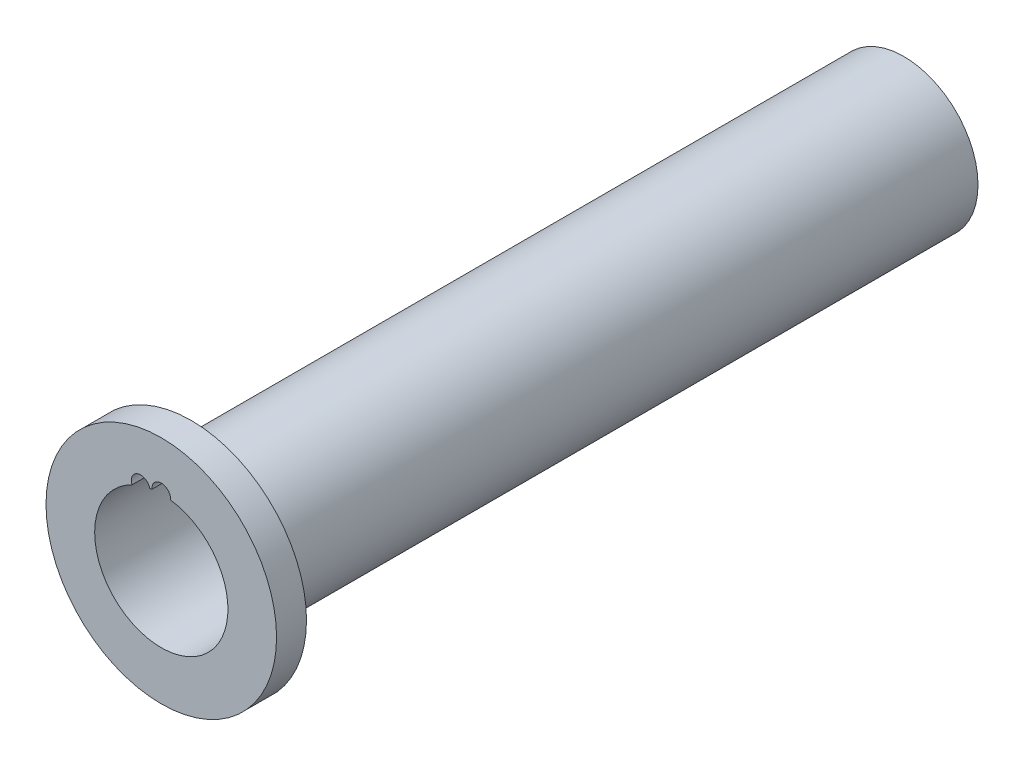
ISO-10303-21;
HEADER;
FILE_DESCRIPTION(('STEP AP214'),'2;1');
FILE_NAME('part.step','',(''),(''),'','','');
FILE_SCHEMA(('AUTOMOTIVE_DESIGN { 1 0 10303 214 1 1 1 1 }'));
ENDSEC;
DATA;
#1=APPLICATION_CONTEXT('core data for automotive mechanical design processes');
#2=APPLICATION_PROTOCOL_DEFINITION('international standard','automotive_design',2000,#1);
#3=PRODUCT_CONTEXT('',#1,'mechanical');
#4=PRODUCT('Part','Part','',(#3));
#5=PRODUCT_RELATED_PRODUCT_CATEGORY('part','',(#4));
#6=PRODUCT_DEFINITION_FORMATION('','',#4);
#7=PRODUCT_DEFINITION_CONTEXT('part definition',#1,'design');
#8=PRODUCT_DEFINITION('design','',#6,#7);
#9=PRODUCT_DEFINITION_SHAPE('','',#8);
#10=(LENGTH_UNIT() NAMED_UNIT(*) SI_UNIT(.MILLI.,.METRE.));
#11=(NAMED_UNIT(*) PLANE_ANGLE_UNIT() SI_UNIT($,.RADIAN.));
#12=(NAMED_UNIT(*) SI_UNIT($,.STERADIAN.) SOLID_ANGLE_UNIT());
#13=UNCERTAINTY_MEASURE_WITH_UNIT(LENGTH_MEASURE(1.E-05),#10,'distance_accuracy_value','');
#14=(GEOMETRIC_REPRESENTATION_CONTEXT(3) GLOBAL_UNCERTAINTY_ASSIGNED_CONTEXT((#13)) GLOBAL_UNIT_ASSIGNED_CONTEXT((#10,
#11,#12)) REPRESENTATION_CONTEXT('',''));
#15=CARTESIAN_POINT('',(0.,0.,0.));
#16=DIRECTION('',(0.,0.,1.));
#17=DIRECTION('',(1.,0.,0.));
#18=AXIS2_PLACEMENT_3D('',#15,#16,#17);
#19=CARTESIAN_POINT('',(0.,0.,47.6));
#20=DIRECTION('',(0.,0.,-1.));
#21=DIRECTION('',(-1.,0.,0.));
#22=AXIS2_PLACEMENT_3D('',#19,#20,#21);
#23=CYLINDRICAL_SURFACE('',#22,4.45);
#24=CARTESIAN_POINT('',(0.,0.,49.6));
#25=DIRECTION('',(0.,0.,1.));
#26=DIRECTION('',(1.,0.,0.));
#27=AXIS2_PLACEMENT_3D('',#24,#25,#26);
#28=CIRCLE('',#27,4.45);
#29=CARTESIAN_POINT('',(-1.95450557084996,3.99780039190509,49.6));
#30=VERTEX_POINT('',#29);
#31=CARTESIAN_POINT('',(0.623456998074536,4.4061095505618,49.6));
#32=VERTEX_POINT('',#31);
#33=EDGE_CURVE('E125',#30,#32,#28,.T.);
#34=ORIENTED_EDGE('',*,*,#33,.T.);
#35=DIRECTION('',(0.,0.,-1.));
#36=VECTOR('',#35,1.);
#37=CARTESIAN_POINT('',(0.623456998074536,4.4061095505618,48.25));
#38=LINE('',#37,#36);
#39=CARTESIAN_POINT('',(0.623456998074536,4.4061095505618,46.9));
#40=VERTEX_POINT('',#39);
#41=EDGE_CURVE('E60',#40,#32,#38,.F.);
#42=ORIENTED_EDGE('',*,*,#41,.F.);
#43=CARTESIAN_POINT('',(0.,0.,46.9));
#44=DIRECTION('',(0.,0.,-1.));
#45=DIRECTION('',(-1.,0.,0.));
#46=AXIS2_PLACEMENT_3D('',#43,#44,#45);
#47=CIRCLE('',#46,4.45);
#48=CARTESIAN_POINT('',(-0.623456998074537,4.4061095505618,46.9));
#49=VERTEX_POINT('',#48);
#50=EDGE_CURVE('E11',#49,#40,#47,.T.);
#51=ORIENTED_EDGE('',*,*,#50,.F.);
#52=DIRECTION('',(0.,0.,-1.));
#53=VECTOR('',#52,1.);
#54=CARTESIAN_POINT('',(-0.623456998074537,4.4061095505618,48.25));
#55=LINE('',#54,#53);
#56=CARTESIAN_POINT('',(-0.623456998074536,4.4061095505618,49.6));
#57=VERTEX_POINT('',#56);
#58=EDGE_CURVE('E105',#57,#49,#55,.T.);
#59=ORIENTED_EDGE('',*,*,#58,.F.);
#60=CARTESIAN_POINT('',(-0.768619889552757,4.38311800723913,49.6));
#61=VERTEX_POINT('',#60);
#62=EDGE_CURVE('E109',#57,#61,#28,.T.);
#63=ORIENTED_EDGE('',*,*,#62,.T.);
#64=DIRECTION('',(0.,0.,-1.));
#65=VECTOR('',#64,1.);
#66=CARTESIAN_POINT('',(-0.768619889552758,4.38311800723913,48.25));
#67=LINE('',#66,#65);
#68=CARTESIAN_POINT('',(-0.768619889552757,4.38311800723913,46.9));
#69=VERTEX_POINT('',#68);
#70=EDGE_CURVE('E52',#69,#61,#67,.F.);
#71=ORIENTED_EDGE('',*,*,#70,.F.);
#72=CARTESIAN_POINT('',(0.,0.,46.9));
#73=DIRECTION('',(0.,0.,-1.));
#74=DIRECTION('',(-1.,0.,0.));
#75=AXIS2_PLACEMENT_3D('',#72,#73,#74);
#76=CIRCLE('',#75,4.45);
#77=CARTESIAN_POINT('',(-1.95450557084996,3.99780039190509,46.9));
#78=VERTEX_POINT('',#77);
#79=EDGE_CURVE('E45',#78,#69,#76,.T.);
#80=ORIENTED_EDGE('',*,*,#79,.F.);
#81=DIRECTION('',(0.,0.,-1.));
#82=VECTOR('',#81,1.);
#83=CARTESIAN_POINT('',(-1.95450557084996,3.99780039190509,48.25));
#84=LINE('',#83,#82);
#85=EDGE_CURVE('E165',#30,#78,#84,.T.);
#86=ORIENTED_EDGE('',*,*,#85,.F.);
#87=EDGE_LOOP('',(#34,#42,#51,#59,#63,#71,#80,#86));
#88=FACE_BOUND('',#87,.T.);
#89=CARTESIAN_POINT('',(0.,0.,0.));
#90=DIRECTION('',(0.,0.,1.));
#91=DIRECTION('',(1.,0.,0.));
#92=AXIS2_PLACEMENT_3D('',#89,#90,#91);
#93=CIRCLE('',#92,4.45);
#94=CARTESIAN_POINT('',(4.45,0.,0.));
#95=VERTEX_POINT('',#94);
#96=EDGE_CURVE('E135',#95,#95,#93,.T.);
#97=ORIENTED_EDGE('',*,*,#96,.F.);
#98=EDGE_LOOP('',(#97));
#99=FACE_BOUND('',#98,.T.);
#100=ADVANCED_FACE('F37',(#88,#99),#23,.F.);
#101=CARTESIAN_POINT('',(0.,0.,0.));
#102=DIRECTION('',(0.,0.,1.));
#103=DIRECTION('',(1.,0.,0.));
#104=AXIS2_PLACEMENT_3D('',#101,#102,#103);
#105=PLANE('',#104);
#106=CARTESIAN_POINT('',(0.,0.,0.));
#107=DIRECTION('',(0.,0.,1.));
#108=DIRECTION('',(1.,0.,0.));
#109=AXIS2_PLACEMENT_3D('',#106,#107,#108);
#110=CIRCLE('',#109,4.95);
#111=CARTESIAN_POINT('',(4.95,0.,0.));
#112=VERTEX_POINT('',#111);
#113=EDGE_CURVE('E139',#112,#112,#110,.T.);
#114=ORIENTED_EDGE('',*,*,#113,.F.);
#115=EDGE_LOOP('',(#114));
#116=FACE_BOUND('',#115,.T.);
#117=ORIENTED_EDGE('',*,*,#96,.T.);
#118=EDGE_LOOP('',(#117));
#119=FACE_BOUND('',#118,.T.);
#120=ADVANCED_FACE('F207',(#116,#119),#105,.F.);
#121=CARTESIAN_POINT('',(0.,0.,47.6));
#122=DIRECTION('',(0.,0.,-1.));
#123=DIRECTION('',(-1.,0.,0.));
#124=AXIS2_PLACEMENT_3D('',#121,#122,#123);
#125=CYLINDRICAL_SURFACE('',#124,4.95);
#126=CARTESIAN_POINT('',(0.,0.,46.9));
#127=DIRECTION('',(0.,0.,-1.));
#128=DIRECTION('',(-1.,0.,0.));
#129=AXIS2_PLACEMENT_3D('',#126,#127,#128);
#130=CIRCLE('',#129,4.95);
#131=CARTESIAN_POINT('',(-0.395190971613255,4.93419943820225,46.9));
#132=VERTEX_POINT('',#131);
#133=CARTESIAN_POINT('',(0.395190971613255,4.93419943820225,46.9));
#134=VERTEX_POINT('',#133);
#135=EDGE_CURVE('E130',#132,#134,#130,.T.);
#136=ORIENTED_EDGE('',*,*,#135,.T.);
#137=DIRECTION('',(0.,0.,-1.));
#138=VECTOR('',#137,1.);
#139=CARTESIAN_POINT('',(0.39519097161325,4.93419943820225,48.25));
#140=LINE('',#139,#138);
#141=CARTESIAN_POINT('',(0.395190971613248,4.93419943820225,47.6));
#142=VERTEX_POINT('',#141);
#143=EDGE_CURVE('E112',#134,#142,#140,.F.);
#144=ORIENTED_EDGE('',*,*,#143,.T.);
#145=CARTESIAN_POINT('',(0.,0.,47.6));
#146=DIRECTION('',(0.,0.,1.));
#147=DIRECTION('',(1.,0.,0.));
#148=AXIS2_PLACEMENT_3D('',#145,#146,#147);
#149=CIRCLE('',#148,4.95);
#150=CARTESIAN_POINT('',(-1.90060042877361,4.57058180215009,47.6));
#151=VERTEX_POINT('',#150);
#152=EDGE_CURVE('E140',#151,#142,#149,.T.);
#153=ORIENTED_EDGE('',*,*,#152,.F.);
#154=DIRECTION('',(0.,0.,-1.));
#155=VECTOR('',#154,1.);
#156=CARTESIAN_POINT('',(-1.90060042877361,4.57058180215009,48.25));
#157=LINE('',#156,#155);
#158=CARTESIAN_POINT('',(-1.90060042877362,4.57058180215009,46.9));
#159=VERTEX_POINT('',#158);
#160=EDGE_CURVE('E118',#151,#159,#157,.T.);
#161=ORIENTED_EDGE('',*,*,#160,.T.);
#162=CARTESIAN_POINT('',(0.,0.,46.9));
#163=DIRECTION('',(0.,0.,-1.));
#164=DIRECTION('',(-1.,0.,0.));
#165=AXIS2_PLACEMENT_3D('',#162,#163,#164);
#166=CIRCLE('',#165,4.95);
#167=CARTESIAN_POINT('',(-1.14890253130602,4.81482325465418,46.9));
#168=VERTEX_POINT('',#167);
#169=EDGE_CURVE('E174',#159,#168,#166,.T.);
#170=ORIENTED_EDGE('',*,*,#169,.T.);
#171=DIRECTION('',(0.,0.,-1.));
#172=VECTOR('',#171,1.);
#173=CARTESIAN_POINT('',(-1.14890253130602,4.81482325465418,48.25));
#174=LINE('',#173,#172);
#175=CARTESIAN_POINT('',(-1.14890253130602,4.81482325465417,47.6));
#176=VERTEX_POINT('',#175);
#177=EDGE_CURVE('E162',#168,#176,#174,.F.);
#178=ORIENTED_EDGE('',*,*,#177,.T.);
#179=CARTESIAN_POINT('',(-0.395190971613248,4.93419943820225,47.6));
#180=VERTEX_POINT('',#179);
#181=EDGE_CURVE('E143',#180,#176,#149,.T.);
#182=ORIENTED_EDGE('',*,*,#181,.F.);
#183=DIRECTION('',(0.,0.,-1.));
#184=VECTOR('',#183,1.);
#185=CARTESIAN_POINT('',(-0.39519097161325,4.93419943820225,48.25));
#186=LINE('',#185,#184);
#187=EDGE_CURVE('E164',#180,#132,#186,.T.);
#188=ORIENTED_EDGE('',*,*,#187,.T.);
#189=EDGE_LOOP('',(#136,#144,#153,#161,#170,#178,#182,#188));
#190=FACE_BOUND('',#189,.T.);
#191=ORIENTED_EDGE('',*,*,#113,.T.);
#192=EDGE_LOOP('',(#191));
#193=FACE_BOUND('',#192,.T.);
#194=ADVANCED_FACE('F39',(#190,#193),#125,.T.);
#195=CARTESIAN_POINT('',(0.,0.,49.6));
#196=DIRECTION('',(0.,0.,1.));
#197=DIRECTION('',(1.,0.,0.));
#198=AXIS2_PLACEMENT_3D('',#195,#196,#197);
#199=PLANE('',#198);
#200=CARTESIAN_POINT('',(0.,4.45,49.6));
#201=DIRECTION('',(0.,0.,1.));
#202=DIRECTION('',(1.,0.,0.));
#203=AXIS2_PLACEMENT_3D('',#200,#201,#202);
#204=CIRCLE('',#203,0.625);
#205=EDGE_CURVE('E114',#57,#32,#204,.F.);
#206=ORIENTED_EDGE('',*,*,#205,.T.);
#207=ORIENTED_EDGE('',*,*,#33,.F.);
#208=CARTESIAN_POINT('',(-1.37512562496852,4.23220149751343,49.6));
#209=DIRECTION('',(0.,0.,1.));
#210=DIRECTION('',(1.,0.,0.));
#211=AXIS2_PLACEMENT_3D('',#208,#209,#210);
#212=CIRCLE('',#211,0.625);
#213=EDGE_CURVE('E123',#30,#61,#212,.F.);
#214=ORIENTED_EDGE('',*,*,#213,.T.);
#215=ORIENTED_EDGE('',*,*,#62,.F.);
#216=EDGE_LOOP('',(#206,#207,#214,#215));
#217=FACE_BOUND('',#216,.T.);
#218=CARTESIAN_POINT('',(0.,0.,49.6));
#219=DIRECTION('',(0.,0.,1.));
#220=DIRECTION('',(1.,0.,0.));
#221=AXIS2_PLACEMENT_3D('',#218,#219,#220);
#222=CIRCLE('',#221,7.7);
#223=CARTESIAN_POINT('',(7.7,0.,49.6));
#224=VERTEX_POINT('',#223);
#225=EDGE_CURVE('E128',#224,#224,#222,.T.);
#226=ORIENTED_EDGE('',*,*,#225,.T.);
#227=EDGE_LOOP('',(#226));
#228=FACE_BOUND('',#227,.T.);
#229=ADVANCED_FACE('F121',(#217,#228),#199,.T.);
#230=CARTESIAN_POINT('',(0.,0.,47.6));
#231=DIRECTION('',(0.,0.,1.));
#232=DIRECTION('',(1.,0.,0.));
#233=AXIS2_PLACEMENT_3D('',#230,#231,#232);
#234=PLANE('',#233);
#235=ORIENTED_EDGE('',*,*,#152,.T.);
#236=CARTESIAN_POINT('',(0.,4.45,47.6));
#237=DIRECTION('',(0.,0.,1.));
#238=DIRECTION('',(1.,0.,0.));
#239=AXIS2_PLACEMENT_3D('',#236,#237,#238);
#240=CIRCLE('',#239,0.625);
#241=EDGE_CURVE('E149',#142,#180,#240,.T.);
#242=ORIENTED_EDGE('',*,*,#241,.T.);
#243=ORIENTED_EDGE('',*,*,#181,.T.);
#244=CARTESIAN_POINT('',(-1.37512562496852,4.23220149751343,47.6));
#245=DIRECTION('',(0.,0.,1.));
#246=DIRECTION('',(1.,0.,0.));
#247=AXIS2_PLACEMENT_3D('',#244,#245,#246);
#248=CIRCLE('',#247,0.625);
#249=EDGE_CURVE('E146',#176,#151,#248,.T.);
#250=ORIENTED_EDGE('',*,*,#249,.T.);
#251=EDGE_LOOP('',(#235,#242,#243,#250));
#252=FACE_BOUND('',#251,.T.);
#253=CARTESIAN_POINT('',(0.,0.,47.6));
#254=DIRECTION('',(0.,0.,1.));
#255=DIRECTION('',(1.,0.,0.));
#256=AXIS2_PLACEMENT_3D('',#253,#254,#255);
#257=CIRCLE('',#256,7.7);
#258=CARTESIAN_POINT('',(7.7,0.,47.6));
#259=VERTEX_POINT('',#258);
#260=EDGE_CURVE('E124',#259,#259,#257,.T.);
#261=ORIENTED_EDGE('',*,*,#260,.F.);
#262=EDGE_LOOP('',(#261));
#263=FACE_BOUND('',#262,.T.);
#264=ADVANCED_FACE('F190',(#252,#263),#234,.F.);
#265=CARTESIAN_POINT('',(0.,0.,49.6));
#266=DIRECTION('',(0.,0.,-1.));
#267=DIRECTION('',(-1.,0.,0.));
#268=AXIS2_PLACEMENT_3D('',#265,#266,#267);
#269=CYLINDRICAL_SURFACE('',#268,7.7);
#270=ORIENTED_EDGE('',*,*,#225,.F.);
#271=EDGE_LOOP('',(#270));
#272=FACE_BOUND('',#271,.T.);
#273=ORIENTED_EDGE('',*,*,#260,.T.);
#274=EDGE_LOOP('',(#273));
#275=FACE_BOUND('',#274,.T.);
#276=ADVANCED_FACE('F193',(#272,#275),#269,.T.);
#277=CARTESIAN_POINT('',(-1.37512562496852,4.23220149751343,46.9));
#278=DIRECTION('',(0.,0.,-1.));
#279=DIRECTION('',(-1.,0.,0.));
#280=AXIS2_PLACEMENT_3D('',#277,#278,#279);
#281=PLANE('',#280);
#282=CARTESIAN_POINT('',(-1.37512562496852,4.23220149751343,46.9));
#283=DIRECTION('',(0.,0.,-1.));
#284=DIRECTION('',(-1.,0.,0.));
#285=AXIS2_PLACEMENT_3D('',#282,#283,#284);
#286=CIRCLE('',#285,0.625);
#287=EDGE_CURVE('E159',#78,#159,#286,.T.);
#288=ORIENTED_EDGE('',*,*,#287,.F.);
#289=ORIENTED_EDGE('',*,*,#79,.T.);
#290=EDGE_CURVE('E156',#168,#69,#286,.T.);
#291=ORIENTED_EDGE('',*,*,#290,.F.);
#292=ORIENTED_EDGE('',*,*,#169,.F.);
#293=EDGE_LOOP('',(#288,#289,#291,#292));
#294=FACE_BOUND('',#293,.T.);
#295=ADVANCED_FACE('F155',(#294),#281,.F.);
#296=CARTESIAN_POINT('',(-1.37512562496852,4.23220149751343,49.601));
#297=DIRECTION('',(0.,0.,-1.));
#298=DIRECTION('',(-1.,0.,0.));
#299=AXIS2_PLACEMENT_3D('',#296,#297,#298);
#300=CYLINDRICAL_SURFACE('',#299,0.625);
#301=ORIENTED_EDGE('',*,*,#70,.T.);
#302=ORIENTED_EDGE('',*,*,#213,.F.);
#303=ORIENTED_EDGE('',*,*,#85,.T.);
#304=ORIENTED_EDGE('',*,*,#287,.T.);
#305=ORIENTED_EDGE('',*,*,#160,.F.);
#306=ORIENTED_EDGE('',*,*,#249,.F.);
#307=ORIENTED_EDGE('',*,*,#177,.F.);
#308=ORIENTED_EDGE('',*,*,#290,.T.);
#309=EDGE_LOOP('',(#301,#302,#303,#304,#305,#306,#307,#308));
#310=FACE_BOUND('',#309,.T.);
#311=ADVANCED_FACE('F160',(#310),#300,.F.);
#312=CARTESIAN_POINT('',(0.,4.45,46.9));
#313=DIRECTION('',(0.,0.,-1.));
#314=DIRECTION('',(-1.,0.,0.));
#315=AXIS2_PLACEMENT_3D('',#312,#313,#314);
#316=PLANE('',#315);
#317=CARTESIAN_POINT('',(0.,4.45,46.9));
#318=DIRECTION('',(0.,0.,-1.));
#319=DIRECTION('',(-1.,0.,0.));
#320=AXIS2_PLACEMENT_3D('',#317,#318,#319);
#321=CIRCLE('',#320,0.625);
#322=EDGE_CURVE('E184',#49,#132,#321,.T.);
#323=ORIENTED_EDGE('',*,*,#322,.F.);
#324=ORIENTED_EDGE('',*,*,#50,.T.);
#325=EDGE_CURVE('E119',#134,#40,#321,.T.);
#326=ORIENTED_EDGE('',*,*,#325,.F.);
#327=ORIENTED_EDGE('',*,*,#135,.F.);
#328=EDGE_LOOP('',(#323,#324,#326,#327));
#329=FACE_BOUND('',#328,.T.);
#330=ADVANCED_FACE('F183',(#329),#316,.F.);
#331=CARTESIAN_POINT('',(0.,4.45,49.601));
#332=DIRECTION('',(0.,0.,-1.));
#333=DIRECTION('',(-1.,0.,0.));
#334=AXIS2_PLACEMENT_3D('',#331,#332,#333);
#335=CYLINDRICAL_SURFACE('',#334,0.625);
#336=ORIENTED_EDGE('',*,*,#41,.T.);
#337=ORIENTED_EDGE('',*,*,#205,.F.);
#338=ORIENTED_EDGE('',*,*,#58,.T.);
#339=ORIENTED_EDGE('',*,*,#322,.T.);
#340=ORIENTED_EDGE('',*,*,#187,.F.);
#341=ORIENTED_EDGE('',*,*,#241,.F.);
#342=ORIENTED_EDGE('',*,*,#143,.F.);
#343=ORIENTED_EDGE('',*,*,#325,.T.);
#344=EDGE_LOOP('',(#336,#337,#338,#339,#340,#341,#342,#343));
#345=FACE_BOUND('',#344,.T.);
#346=ADVANCED_FACE('F115',(#345),#335,.F.);
#347=CLOSED_SHELL('',(#100,#120,#194,#229,#264,#276,#295,#311,#330,#346));
#348=MANIFOLD_SOLID_BREP('B2',#347);
#349=ADVANCED_BREP_SHAPE_REPRESENTATION('',(#18,#348),#14);
#350=SHAPE_DEFINITION_REPRESENTATION(#9,#349);
ENDSEC;
END-ISO-10303-21;
